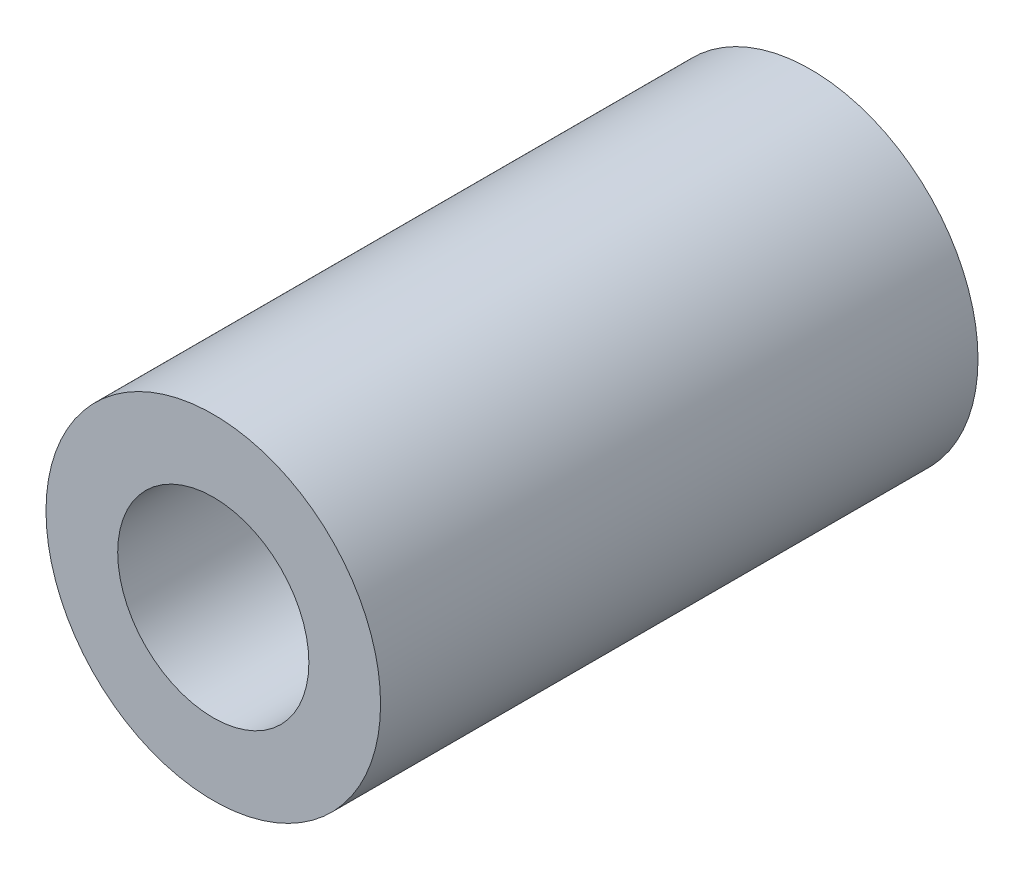
ISO-10303-21;
HEADER;
FILE_DESCRIPTION(('STEP AP214'),'2;1');
FILE_NAME('part.step','',(''),(''),'','','');
FILE_SCHEMA(('AUTOMOTIVE_DESIGN { 1 0 10303 214 1 1 1 1 }'));
ENDSEC;
DATA;
#1=APPLICATION_CONTEXT('core data for automotive mechanical design processes');
#2=APPLICATION_PROTOCOL_DEFINITION('international standard','automotive_design',2000,#1);
#3=PRODUCT_CONTEXT('',#1,'mechanical');
#4=PRODUCT('Part','Part','',(#3));
#5=PRODUCT_RELATED_PRODUCT_CATEGORY('part','',(#4));
#6=PRODUCT_DEFINITION_FORMATION('','',#4);
#7=PRODUCT_DEFINITION_CONTEXT('part definition',#1,'design');
#8=PRODUCT_DEFINITION('design','',#6,#7);
#9=PRODUCT_DEFINITION_SHAPE('','',#8);
#10=(LENGTH_UNIT() NAMED_UNIT(*) SI_UNIT(.MILLI.,.METRE.));
#11=(NAMED_UNIT(*) PLANE_ANGLE_UNIT() SI_UNIT($,.RADIAN.));
#12=(NAMED_UNIT(*) SI_UNIT($,.STERADIAN.) SOLID_ANGLE_UNIT());
#13=UNCERTAINTY_MEASURE_WITH_UNIT(LENGTH_MEASURE(1.E-05),#10,'distance_accuracy_value','');
#14=(GEOMETRIC_REPRESENTATION_CONTEXT(3) GLOBAL_UNCERTAINTY_ASSIGNED_CONTEXT((#13)) GLOBAL_UNIT_ASSIGNED_CONTEXT((#10,
#11,#12)) REPRESENTATION_CONTEXT('',''));
#15=CARTESIAN_POINT('',(0.,0.,0.));
#16=DIRECTION('',(0.,0.,1.));
#17=DIRECTION('',(1.,0.,0.));
#18=AXIS2_PLACEMENT_3D('',#15,#16,#17);
#19=CARTESIAN_POINT('',(0.,0.,25.));
#20=DIRECTION('',(0.,0.,-1.));
#21=DIRECTION('',(-1.,0.,0.));
#22=AXIS2_PLACEMENT_3D('',#19,#20,#21);
#23=CYLINDRICAL_SURFACE('',#22,3.);
#24=CARTESIAN_POINT('',(0.,0.,0.));
#25=DIRECTION('',(0.,0.,1.));
#26=DIRECTION('',(1.,0.,0.));
#27=AXIS2_PLACEMENT_3D('',#24,#25,#26);
#28=CIRCLE('',#27,3.);
#29=CARTESIAN_POINT('',(3.,0.,0.));
#30=VERTEX_POINT('',#29);
#31=EDGE_CURVE('E50',#30,#30,#28,.T.);
#32=ORIENTED_EDGE('',*,*,#31,.F.);
#33=EDGE_LOOP('',(#32));
#34=FACE_BOUND('',#33,.T.);
#35=CARTESIAN_POINT('',(0.,0.,12.));
#36=DIRECTION('',(0.,0.,1.));
#37=DIRECTION('',(1.,0.,0.));
#38=AXIS2_PLACEMENT_3D('',#35,#36,#37);
#39=CIRCLE('',#38,3.);
#40=CARTESIAN_POINT('',(3.,0.,12.));
#41=VERTEX_POINT('',#40);
#42=EDGE_CURVE('E41',#41,#41,#39,.T.);
#43=ORIENTED_EDGE('',*,*,#42,.T.);
#44=EDGE_LOOP('',(#43));
#45=FACE_BOUND('',#44,.T.);
#46=ADVANCED_FACE('F37',(#34,#45),#23,.F.);
#47=CARTESIAN_POINT('',(0.,0.,25.));
#48=DIRECTION('',(0.,0.,1.));
#49=DIRECTION('',(1.,0.,0.));
#50=AXIS2_PLACEMENT_3D('',#47,#48,#49);
#51=PLANE('',#50);
#52=CARTESIAN_POINT('',(0.,0.,25.));
#53=DIRECTION('',(0.,0.,1.));
#54=DIRECTION('',(1.,0.,0.));
#55=AXIS2_PLACEMENT_3D('',#52,#53,#54);
#56=CIRCLE('',#55,4.);
#57=CARTESIAN_POINT('',(4.,0.,25.));
#58=VERTEX_POINT('',#57);
#59=EDGE_CURVE('E54',#58,#58,#56,.T.);
#60=ORIENTED_EDGE('',*,*,#59,.F.);
#61=EDGE_LOOP('',(#60));
#62=FACE_BOUND('',#61,.T.);
#63=CARTESIAN_POINT('',(0.,0.,25.));
#64=DIRECTION('',(0.,0.,1.));
#65=DIRECTION('',(1.,0.,0.));
#66=AXIS2_PLACEMENT_3D('',#63,#64,#65);
#67=CIRCLE('',#66,7.);
#68=CARTESIAN_POINT('',(7.,0.,25.));
#69=VERTEX_POINT('',#68);
#70=EDGE_CURVE('E10',#69,#69,#67,.T.);
#71=ORIENTED_EDGE('',*,*,#70,.T.);
#72=EDGE_LOOP('',(#71));
#73=FACE_BOUND('',#72,.T.);
#74=ADVANCED_FACE('F75',(#62,#73),#51,.T.);
#75=CARTESIAN_POINT('',(0.,0.,0.));
#76=DIRECTION('',(0.,0.,1.));
#77=DIRECTION('',(1.,0.,0.));
#78=AXIS2_PLACEMENT_3D('',#75,#76,#77);
#79=PLANE('',#78);
#80=CARTESIAN_POINT('',(0.,0.,0.));
#81=DIRECTION('',(0.,0.,1.));
#82=DIRECTION('',(1.,0.,0.));
#83=AXIS2_PLACEMENT_3D('',#80,#81,#82);
#84=CIRCLE('',#83,7.);
#85=CARTESIAN_POINT('',(7.,0.,0.));
#86=VERTEX_POINT('',#85);
#87=EDGE_CURVE('E45',#86,#86,#84,.T.);
#88=ORIENTED_EDGE('',*,*,#87,.F.);
#89=EDGE_LOOP('',(#88));
#90=FACE_BOUND('',#89,.T.);
#91=ORIENTED_EDGE('',*,*,#31,.T.);
#92=EDGE_LOOP('',(#91));
#93=FACE_BOUND('',#92,.T.);
#94=ADVANCED_FACE('F82',(#90,#93),#79,.F.);
#95=CARTESIAN_POINT('',(0.,0.,25.));
#96=DIRECTION('',(0.,0.,-1.));
#97=DIRECTION('',(-1.,0.,0.));
#98=AXIS2_PLACEMENT_3D('',#95,#96,#97);
#99=CYLINDRICAL_SURFACE('',#98,7.);
#100=ORIENTED_EDGE('',*,*,#70,.F.);
#101=EDGE_LOOP('',(#100));
#102=FACE_BOUND('',#101,.T.);
#103=ORIENTED_EDGE('',*,*,#87,.T.);
#104=EDGE_LOOP('',(#103));
#105=FACE_BOUND('',#104,.T.);
#106=ADVANCED_FACE('F39',(#102,#105),#99,.T.);
#107=CARTESIAN_POINT('',(0.,0.,12.));
#108=DIRECTION('',(0.,0.,1.));
#109=DIRECTION('',(1.,0.,0.));
#110=AXIS2_PLACEMENT_3D('',#107,#108,#109);
#111=CYLINDRICAL_SURFACE('',#110,4.);
#112=CARTESIAN_POINT('',(0.,0.,12.));
#113=DIRECTION('',(0.,0.,1.));
#114=DIRECTION('',(1.,0.,0.));
#115=AXIS2_PLACEMENT_3D('',#112,#113,#114);
#116=CIRCLE('',#115,4.);
#117=CARTESIAN_POINT('',(4.,0.,12.));
#118=VERTEX_POINT('',#117);
#119=EDGE_CURVE('E57',#118,#118,#116,.T.);
#120=ORIENTED_EDGE('',*,*,#119,.F.);
#121=EDGE_LOOP('',(#120));
#122=FACE_BOUND('',#121,.T.);
#123=ORIENTED_EDGE('',*,*,#59,.T.);
#124=EDGE_LOOP('',(#123));
#125=FACE_BOUND('',#124,.T.);
#126=ADVANCED_FACE('F67',(#122,#125),#111,.F.);
#127=CARTESIAN_POINT('',(0.,0.,12.));
#128=DIRECTION('',(0.,0.,1.));
#129=DIRECTION('',(1.,0.,0.));
#130=AXIS2_PLACEMENT_3D('',#127,#128,#129);
#131=PLANE('',#130);
#132=ORIENTED_EDGE('',*,*,#42,.F.);
#133=EDGE_LOOP('',(#132));
#134=FACE_BOUND('',#133,.T.);
#135=ORIENTED_EDGE('',*,*,#119,.T.);
#136=EDGE_LOOP('',(#135));
#137=FACE_BOUND('',#136,.T.);
#138=ADVANCED_FACE('F65',(#134,#137),#131,.T.);
#139=CLOSED_SHELL('',(#46,#74,#94,#106,#126,#138));
#140=MANIFOLD_SOLID_BREP('B2',#139);
#141=ADVANCED_BREP_SHAPE_REPRESENTATION('',(#18,#140),#14);
#142=SHAPE_DEFINITION_REPRESENTATION(#9,#141);
ENDSEC;
END-ISO-10303-21;
